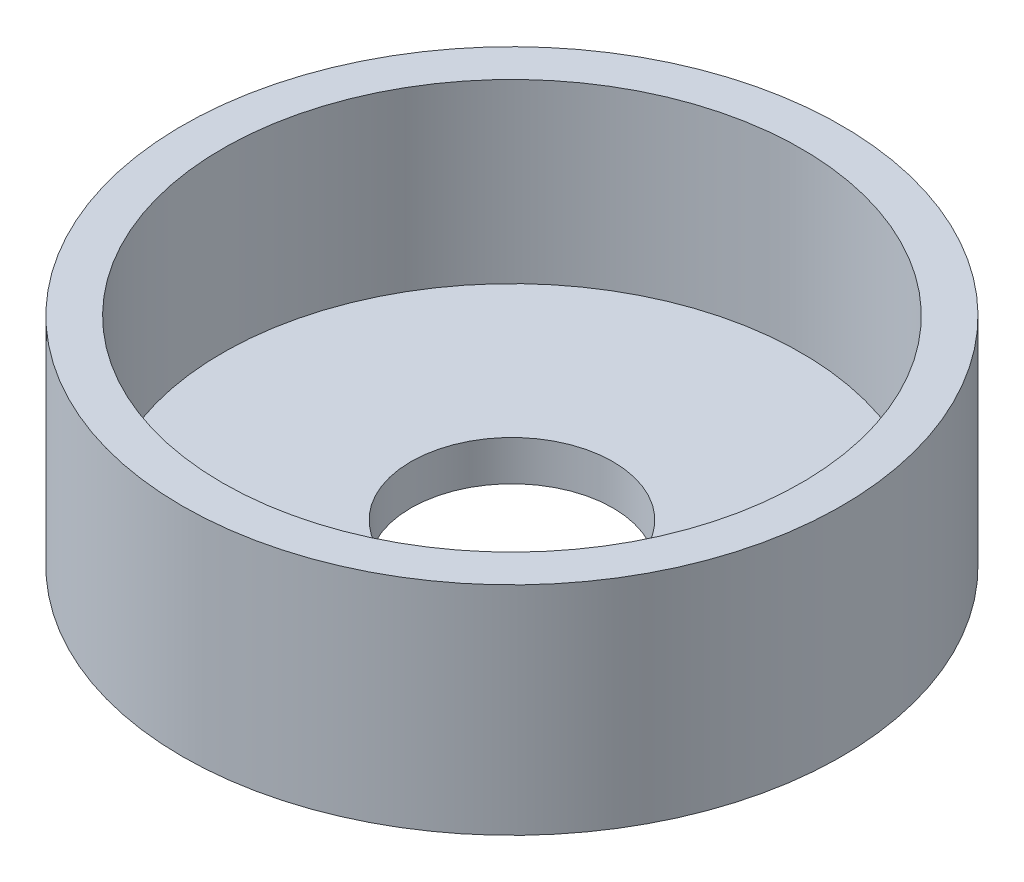
ISO-10303-21;
HEADER;
FILE_DESCRIPTION(('STEP AP214'),'2;1');
FILE_NAME('part.step','',(''),(''),'','','');
FILE_SCHEMA(('AUTOMOTIVE_DESIGN { 1 0 10303 214 1 1 1 1 }'));
ENDSEC;
DATA;
#1=APPLICATION_CONTEXT('core data for automotive mechanical design processes');
#2=APPLICATION_PROTOCOL_DEFINITION('international standard','automotive_design',2000,#1);
#3=PRODUCT_CONTEXT('',#1,'mechanical');
#4=PRODUCT('Part','Part','',(#3));
#5=PRODUCT_RELATED_PRODUCT_CATEGORY('part','',(#4));
#6=PRODUCT_DEFINITION_FORMATION('','',#4);
#7=PRODUCT_DEFINITION_CONTEXT('part definition',#1,'design');
#8=PRODUCT_DEFINITION('design','',#6,#7);
#9=PRODUCT_DEFINITION_SHAPE('','',#8);
#10=(LENGTH_UNIT() NAMED_UNIT(*) SI_UNIT(.MILLI.,.METRE.));
#11=(NAMED_UNIT(*) PLANE_ANGLE_UNIT() SI_UNIT($,.RADIAN.));
#12=(NAMED_UNIT(*) SI_UNIT($,.STERADIAN.) SOLID_ANGLE_UNIT());
#13=UNCERTAINTY_MEASURE_WITH_UNIT(LENGTH_MEASURE(1.E-05),#10,'distance_accuracy_value','');
#14=(GEOMETRIC_REPRESENTATION_CONTEXT(3) GLOBAL_UNCERTAINTY_ASSIGNED_CONTEXT((#13)) GLOBAL_UNIT_ASSIGNED_CONTEXT((#10,
#11,#12)) REPRESENTATION_CONTEXT('',''));
#15=CARTESIAN_POINT('',(0.,0.,0.));
#16=DIRECTION('',(0.,0.,1.));
#17=DIRECTION('',(1.,0.,0.));
#18=AXIS2_PLACEMENT_3D('',#15,#16,#17);
#19=CARTESIAN_POINT('',(0.,0.,0.));
#20=DIRECTION('',(0.,1.,0.));
#21=DIRECTION('',(0.,0.,1.));
#22=AXIS2_PLACEMENT_3D('',#19,#20,#21);
#23=PLANE('',#22);
#24=CARTESIAN_POINT('',(0.,0.,0.));
#25=DIRECTION('',(0.,1.,0.));
#26=DIRECTION('',(0.,0.,1.));
#27=AXIS2_PLACEMENT_3D('',#24,#25,#26);
#28=CIRCLE('',#27,4.0005);
#29=CARTESIAN_POINT('',(0.,0.,4.0005));
#30=VERTEX_POINT('',#29);
#31=EDGE_CURVE('E56',#30,#30,#28,.T.);
#32=ORIENTED_EDGE('',*,*,#31,.T.);
#33=EDGE_LOOP('',(#32));
#34=FACE_BOUND('',#33,.T.);
#35=CARTESIAN_POINT('',(0.,0.,0.));
#36=DIRECTION('',(0.,1.,0.));
#37=DIRECTION('',(0.,0.,1.));
#38=AXIS2_PLACEMENT_3D('',#35,#36,#37);
#39=CIRCLE('',#38,13.045833303125);
#40=CARTESIAN_POINT('',(0.,0.,13.045833303125));
#41=VERTEX_POINT('',#40);
#42=EDGE_CURVE('E43',#41,#41,#39,.T.);
#43=ORIENTED_EDGE('',*,*,#42,.F.);
#44=EDGE_LOOP('',(#43));
#45=FACE_BOUND('',#44,.T.);
#46=ADVANCED_FACE('F37',(#34,#45),#23,.F.);
#47=CARTESIAN_POINT('',(0.,0.,0.));
#48=DIRECTION('',(0.,1.,0.));
#49=DIRECTION('',(0.,0.,1.));
#50=AXIS2_PLACEMENT_3D('',#47,#48,#49);
#51=CYLINDRICAL_SURFACE('',#50,13.045833303125);
#52=ORIENTED_EDGE('',*,*,#42,.T.);
#53=EDGE_LOOP('',(#52));
#54=FACE_BOUND('',#53,.T.);
#55=CARTESIAN_POINT('',(0.,8.5875,0.));
#56=DIRECTION('',(0.,1.,0.));
#57=DIRECTION('',(0.,0.,1.));
#58=AXIS2_PLACEMENT_3D('',#55,#56,#57);
#59=CIRCLE('',#58,13.045833303125);
#60=CARTESIAN_POINT('',(0.,8.5875,13.045833303125));
#61=VERTEX_POINT('',#60);
#62=EDGE_CURVE('E47',#61,#61,#59,.T.);
#63=ORIENTED_EDGE('',*,*,#62,.F.);
#64=EDGE_LOOP('',(#63));
#65=FACE_BOUND('',#64,.T.);
#66=ADVANCED_FACE('F83',(#54,#65),#51,.T.);
#67=CARTESIAN_POINT('',(0.,8.5875,0.));
#68=DIRECTION('',(0.,1.,0.));
#69=DIRECTION('',(0.,0.,1.));
#70=AXIS2_PLACEMENT_3D('',#67,#68,#69);
#71=PLANE('',#70);
#72=ORIENTED_EDGE('',*,*,#62,.T.);
#73=EDGE_LOOP('',(#72));
#74=FACE_BOUND('',#73,.T.);
#75=CARTESIAN_POINT('',(0.,8.5875,0.));
#76=DIRECTION('',(0.,1.,0.));
#77=DIRECTION('',(0.,0.,1.));
#78=AXIS2_PLACEMENT_3D('',#75,#76,#77);
#79=CIRCLE('',#78,11.458333303125);
#80=CARTESIAN_POINT('',(0.,8.5875,11.458333303125));
#81=VERTEX_POINT('',#80);
#82=EDGE_CURVE('E51',#81,#81,#79,.T.);
#83=ORIENTED_EDGE('',*,*,#82,.F.);
#84=EDGE_LOOP('',(#83));
#85=FACE_BOUND('',#84,.T.);
#86=ADVANCED_FACE('F78',(#74,#85),#71,.T.);
#87=CARTESIAN_POINT('',(0.,8.5875,0.));
#88=DIRECTION('',(0.,-1.,0.));
#89=DIRECTION('',(0.,0.,-1.));
#90=AXIS2_PLACEMENT_3D('',#87,#88,#89);
#91=CYLINDRICAL_SURFACE('',#90,11.458333303125);
#92=ORIENTED_EDGE('',*,*,#82,.T.);
#93=EDGE_LOOP('',(#92));
#94=FACE_BOUND('',#93,.T.);
#95=CARTESIAN_POINT('',(0.,1.5875,0.));
#96=DIRECTION('',(0.,1.,0.));
#97=DIRECTION('',(0.,0.,1.));
#98=AXIS2_PLACEMENT_3D('',#95,#96,#97);
#99=CIRCLE('',#98,11.458333303125);
#100=CARTESIAN_POINT('',(0.,1.5875,11.458333303125));
#101=VERTEX_POINT('',#100);
#102=EDGE_CURVE('E11',#101,#101,#99,.F.);
#103=ORIENTED_EDGE('',*,*,#102,.T.);
#104=EDGE_LOOP('',(#103));
#105=FACE_BOUND('',#104,.T.);
#106=ADVANCED_FACE('F74',(#94,#105),#91,.F.);
#107=CARTESIAN_POINT('',(0.,1.5875,0.));
#108=DIRECTION('',(0.,1.,0.));
#109=DIRECTION('',(0.,0.,1.));
#110=AXIS2_PLACEMENT_3D('',#107,#108,#109);
#111=PLANE('',#110);
#112=CARTESIAN_POINT('',(0.,1.5875,0.));
#113=DIRECTION('',(0.,1.,0.));
#114=DIRECTION('',(0.,0.,1.));
#115=AXIS2_PLACEMENT_3D('',#112,#113,#114);
#116=CIRCLE('',#115,4.0005);
#117=CARTESIAN_POINT('',(0.,1.5875,4.0005));
#118=VERTEX_POINT('',#117);
#119=EDGE_CURVE('E57',#118,#118,#116,.T.);
#120=ORIENTED_EDGE('',*,*,#119,.F.);
#121=EDGE_LOOP('',(#120));
#122=FACE_BOUND('',#121,.T.);
#123=ORIENTED_EDGE('',*,*,#102,.F.);
#124=EDGE_LOOP('',(#123));
#125=FACE_BOUND('',#124,.T.);
#126=ADVANCED_FACE('F68',(#122,#125),#111,.T.);
#127=CARTESIAN_POINT('',(0.,0.,0.));
#128=DIRECTION('',(0.,1.,0.));
#129=DIRECTION('',(0.,0.,1.));
#130=AXIS2_PLACEMENT_3D('',#127,#128,#129);
#131=CYLINDRICAL_SURFACE('',#130,4.0005);
#132=ORIENTED_EDGE('',*,*,#31,.F.);
#133=EDGE_LOOP('',(#132));
#134=FACE_BOUND('',#133,.T.);
#135=ORIENTED_EDGE('',*,*,#119,.T.);
#136=EDGE_LOOP('',(#135));
#137=FACE_BOUND('',#136,.T.);
#138=ADVANCED_FACE('F65',(#134,#137),#131,.F.);
#139=CLOSED_SHELL('',(#46,#66,#86,#106,#126,#138));
#140=MANIFOLD_SOLID_BREP('B2',#139);
#141=ADVANCED_BREP_SHAPE_REPRESENTATION('',(#18,#140),#14);
#142=SHAPE_DEFINITION_REPRESENTATION(#9,#141);
ENDSEC;
END-ISO-10303-21;
